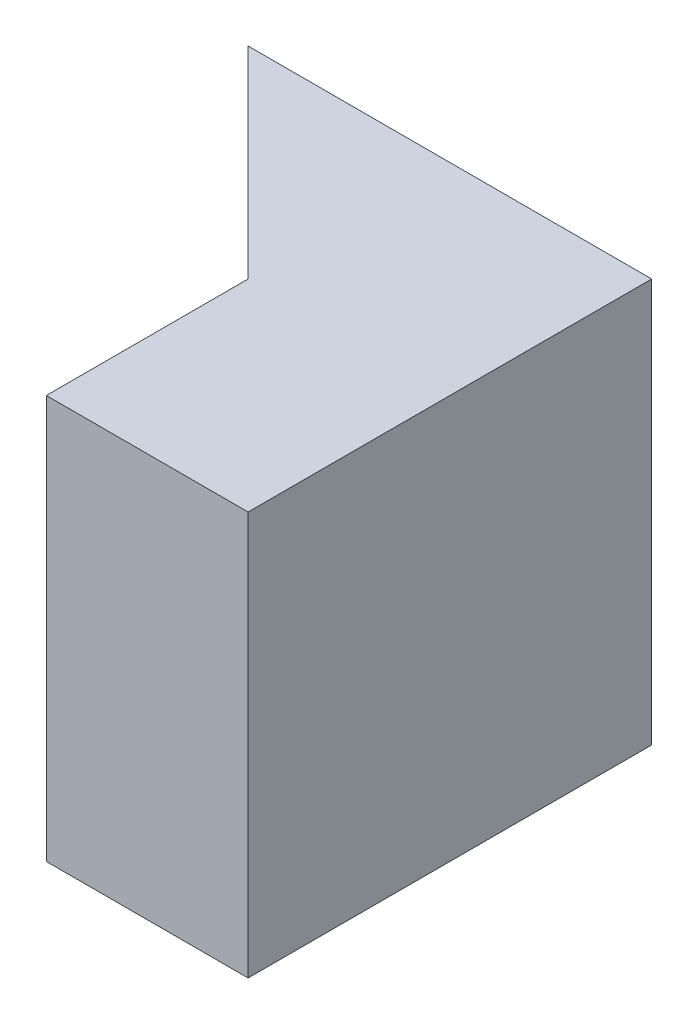
ISO-10303-21;
HEADER;
FILE_DESCRIPTION(('STEP AP214'),'2;1');
FILE_NAME('part.step','',(''),(''),'','','');
FILE_SCHEMA(('AUTOMOTIVE_DESIGN { 1 0 10303 214 1 1 1 1 }'));
ENDSEC;
DATA;
#1=APPLICATION_CONTEXT('core data for automotive mechanical design processes');
#2=APPLICATION_PROTOCOL_DEFINITION('international standard','automotive_design',2000,#1);
#3=PRODUCT_CONTEXT('',#1,'mechanical');
#4=PRODUCT('Part','Part','',(#3));
#5=PRODUCT_RELATED_PRODUCT_CATEGORY('part','',(#4));
#6=PRODUCT_DEFINITION_FORMATION('','',#4);
#7=PRODUCT_DEFINITION_CONTEXT('part definition',#1,'design');
#8=PRODUCT_DEFINITION('design','',#6,#7);
#9=PRODUCT_DEFINITION_SHAPE('','',#8);
#10=(LENGTH_UNIT() NAMED_UNIT(*) SI_UNIT(.MILLI.,.METRE.));
#11=(NAMED_UNIT(*) PLANE_ANGLE_UNIT() SI_UNIT($,.RADIAN.));
#12=(NAMED_UNIT(*) SI_UNIT($,.STERADIAN.) SOLID_ANGLE_UNIT());
#13=UNCERTAINTY_MEASURE_WITH_UNIT(LENGTH_MEASURE(1.E-05),#10,'distance_accuracy_value','');
#14=(GEOMETRIC_REPRESENTATION_CONTEXT(3) GLOBAL_UNCERTAINTY_ASSIGNED_CONTEXT((#13)) GLOBAL_UNIT_ASSIGNED_CONTEXT((#10,
#11,#12)) REPRESENTATION_CONTEXT('',''));
#15=CARTESIAN_POINT('',(0.,0.,0.));
#16=DIRECTION('',(0.,0.,1.));
#17=DIRECTION('',(1.,0.,0.));
#18=AXIS2_PLACEMENT_3D('',#15,#16,#17);
#19=CARTESIAN_POINT('',(0.,0.,20.));
#20=DIRECTION('',(0.,1.,0.));
#21=DIRECTION('',(0.,0.,1.));
#22=AXIS2_PLACEMENT_3D('',#19,#20,#21);
#23=PLANE('',#22);
#24=DIRECTION('',(0.,0.,-1.));
#25=VECTOR('',#24,1.);
#26=CARTESIAN_POINT('',(10.,0.,20.));
#27=LINE('',#26,#25);
#28=CARTESIAN_POINT('',(10.,0.,20.));
#29=VERTEX_POINT('',#28);
#30=CARTESIAN_POINT('',(10.,0.,10.));
#31=VERTEX_POINT('',#30);
#32=EDGE_CURVE('E47',#29,#31,#27,.T.);
#33=ORIENTED_EDGE('',*,*,#32,.T.);
#34=DIRECTION('',(-0.707106781186548,0.,-0.707106781186547));
#35=VECTOR('',#34,1.);
#36=CARTESIAN_POINT('',(0.,0.,0.));
#37=LINE('',#36,#35);
#38=CARTESIAN_POINT('',(0.,0.,0.));
#39=VERTEX_POINT('',#38);
#40=EDGE_CURVE('E106',#31,#39,#37,.T.);
#41=ORIENTED_EDGE('',*,*,#40,.T.);
#42=DIRECTION('',(1.,0.,0.));
#43=VECTOR('',#42,1.);
#44=CARTESIAN_POINT('',(0.,0.,0.));
#45=LINE('',#44,#43);
#46=CARTESIAN_POINT('',(20.,0.,0.));
#47=VERTEX_POINT('',#46);
#48=EDGE_CURVE('E77',#39,#47,#45,.T.);
#49=ORIENTED_EDGE('',*,*,#48,.T.);
#50=DIRECTION('',(0.,0.,-1.));
#51=VECTOR('',#50,1.);
#52=CARTESIAN_POINT('',(20.,0.,20.));
#53=LINE('',#52,#51);
#54=CARTESIAN_POINT('',(20.,0.,20.));
#55=VERTEX_POINT('',#54);
#56=EDGE_CURVE('E11',#55,#47,#53,.T.);
#57=ORIENTED_EDGE('',*,*,#56,.F.);
#58=DIRECTION('',(1.,0.,0.));
#59=VECTOR('',#58,1.);
#60=CARTESIAN_POINT('',(0.,0.,20.));
#61=LINE('',#60,#59);
#62=EDGE_CURVE('E90',#29,#55,#61,.T.);
#63=ORIENTED_EDGE('',*,*,#62,.F.);
#64=EDGE_LOOP('',(#33,#41,#49,#57,#63));
#65=FACE_BOUND('',#64,.T.);
#66=ADVANCED_FACE('F33',(#65),#23,.F.);
#67=CARTESIAN_POINT('',(20.,0.,20.));
#68=DIRECTION('',(-1.,0.,0.));
#69=DIRECTION('',(0.,-1.,0.));
#70=AXIS2_PLACEMENT_3D('',#67,#68,#69);
#71=PLANE('',#70);
#72=DIRECTION('',(0.,1.,0.));
#73=VECTOR('',#72,1.);
#74=CARTESIAN_POINT('',(20.,0.,0.));
#75=LINE('',#74,#73);
#76=CARTESIAN_POINT('',(20.,20.,0.));
#77=VERTEX_POINT('',#76);
#78=EDGE_CURVE('E68',#47,#77,#75,.T.);
#79=ORIENTED_EDGE('',*,*,#78,.T.);
#80=DIRECTION('',(0.,0.,-1.));
#81=VECTOR('',#80,1.);
#82=CARTESIAN_POINT('',(20.,20.,20.));
#83=LINE('',#82,#81);
#84=CARTESIAN_POINT('',(20.,20.,20.));
#85=VERTEX_POINT('',#84);
#86=EDGE_CURVE('E40',#85,#77,#83,.T.);
#87=ORIENTED_EDGE('',*,*,#86,.F.);
#88=DIRECTION('',(0.,1.,0.));
#89=VECTOR('',#88,1.);
#90=CARTESIAN_POINT('',(20.,0.,20.));
#91=LINE('',#90,#89);
#92=EDGE_CURVE('E56',#55,#85,#91,.T.);
#93=ORIENTED_EDGE('',*,*,#92,.F.);
#94=ORIENTED_EDGE('',*,*,#56,.T.);
#95=EDGE_LOOP('',(#79,#87,#93,#94));
#96=FACE_BOUND('',#95,.T.);
#97=ADVANCED_FACE('F70',(#96),#71,.F.);
#98=CARTESIAN_POINT('',(0.,20.,20.));
#99=DIRECTION('',(0.,-1.,0.));
#100=DIRECTION('',(0.,0.,-1.));
#101=AXIS2_PLACEMENT_3D('',#98,#99,#100);
#102=PLANE('',#101);
#103=DIRECTION('',(-1.,0.,0.));
#104=VECTOR('',#103,1.);
#105=CARTESIAN_POINT('',(0.,20.,0.));
#106=LINE('',#105,#104);
#107=CARTESIAN_POINT('',(0.,20.,0.));
#108=VERTEX_POINT('',#107);
#109=EDGE_CURVE('E76',#77,#108,#106,.T.);
#110=ORIENTED_EDGE('',*,*,#109,.T.);
#111=DIRECTION('',(-0.707106781186548,0.,-0.707106781186547));
#112=VECTOR('',#111,1.);
#113=CARTESIAN_POINT('',(0.,20.,0.));
#114=LINE('',#113,#112);
#115=CARTESIAN_POINT('',(10.,20.,10.));
#116=VERTEX_POINT('',#115);
#117=EDGE_CURVE('E108',#116,#108,#114,.T.);
#118=ORIENTED_EDGE('',*,*,#117,.F.);
#119=DIRECTION('',(0.,0.,-1.));
#120=VECTOR('',#119,1.);
#121=CARTESIAN_POINT('',(10.,20.,20.));
#122=LINE('',#121,#120);
#123=CARTESIAN_POINT('',(10.,20.,20.));
#124=VERTEX_POINT('',#123);
#125=EDGE_CURVE('E103',#124,#116,#122,.T.);
#126=ORIENTED_EDGE('',*,*,#125,.F.);
#127=DIRECTION('',(-1.,0.,0.));
#128=VECTOR('',#127,1.);
#129=CARTESIAN_POINT('',(0.,20.,20.));
#130=LINE('',#129,#128);
#131=EDGE_CURVE('E86',#85,#124,#130,.T.);
#132=ORIENTED_EDGE('',*,*,#131,.F.);
#133=ORIENTED_EDGE('',*,*,#86,.T.);
#134=EDGE_LOOP('',(#110,#118,#126,#132,#133));
#135=FACE_BOUND('',#134,.T.);
#136=ADVANCED_FACE('F81',(#135),#102,.F.);
#137=CARTESIAN_POINT('',(0.,0.,20.));
#138=DIRECTION('',(0.,0.,-1.));
#139=DIRECTION('',(-1.,0.,0.));
#140=AXIS2_PLACEMENT_3D('',#137,#138,#139);
#141=PLANE('',#140);
#142=ORIENTED_EDGE('',*,*,#131,.T.);
#143=DIRECTION('',(0.,1.,0.));
#144=VECTOR('',#143,1.);
#145=CARTESIAN_POINT('',(10.,0.,20.));
#146=LINE('',#145,#144);
#147=EDGE_CURVE('E99',#29,#124,#146,.T.);
#148=ORIENTED_EDGE('',*,*,#147,.F.);
#149=ORIENTED_EDGE('',*,*,#62,.T.);
#150=ORIENTED_EDGE('',*,*,#92,.T.);
#151=EDGE_LOOP('',(#142,#148,#149,#150));
#152=FACE_BOUND('',#151,.T.);
#153=ADVANCED_FACE('F124',(#152),#141,.F.);
#154=CARTESIAN_POINT('',(0.,0.,0.));
#155=DIRECTION('',(0.,0.,-1.));
#156=DIRECTION('',(-1.,0.,0.));
#157=AXIS2_PLACEMENT_3D('',#154,#155,#156);
#158=PLANE('',#157);
#159=DIRECTION('',(0.,-1.,0.));
#160=VECTOR('',#159,1.);
#161=CARTESIAN_POINT('',(0.,0.,0.));
#162=LINE('',#161,#160);
#163=EDGE_CURVE('E89',#108,#39,#162,.T.);
#164=ORIENTED_EDGE('',*,*,#163,.F.);
#165=ORIENTED_EDGE('',*,*,#109,.F.);
#166=ORIENTED_EDGE('',*,*,#78,.F.);
#167=ORIENTED_EDGE('',*,*,#48,.F.);
#168=EDGE_LOOP('',(#164,#165,#166,#167));
#169=FACE_BOUND('',#168,.T.);
#170=ADVANCED_FACE('F87',(#169),#158,.T.);
#171=CARTESIAN_POINT('',(10.,0.,20.));
#172=DIRECTION('',(1.,0.,0.));
#173=DIRECTION('',(0.,0.,-1.));
#174=AXIS2_PLACEMENT_3D('',#171,#172,#173);
#175=PLANE('',#174);
#176=ORIENTED_EDGE('',*,*,#125,.T.);
#177=DIRECTION('',(0.,1.,0.));
#178=VECTOR('',#177,1.);
#179=CARTESIAN_POINT('',(10.,0.,10.));
#180=LINE('',#179,#178);
#181=EDGE_CURVE('E96',#31,#116,#180,.T.);
#182=ORIENTED_EDGE('',*,*,#181,.F.);
#183=ORIENTED_EDGE('',*,*,#32,.F.);
#184=ORIENTED_EDGE('',*,*,#147,.T.);
#185=EDGE_LOOP('',(#176,#182,#183,#184));
#186=FACE_BOUND('',#185,.T.);
#187=ADVANCED_FACE('F122',(#186),#175,.F.);
#188=CARTESIAN_POINT('',(0.,0.,0.));
#189=DIRECTION('',(0.707106781186547,0.,-0.707106781186548));
#190=DIRECTION('',(-0.707106781186548,0.,-0.707106781186547));
#191=AXIS2_PLACEMENT_3D('',#188,#189,#190);
#192=PLANE('',#191);
#193=ORIENTED_EDGE('',*,*,#117,.T.);
#194=ORIENTED_EDGE('',*,*,#163,.T.);
#195=ORIENTED_EDGE('',*,*,#40,.F.);
#196=ORIENTED_EDGE('',*,*,#181,.T.);
#197=EDGE_LOOP('',(#193,#194,#195,#196));
#198=FACE_BOUND('',#197,.T.);
#199=ADVANCED_FACE('F119',(#198),#192,.F.);
#200=CLOSED_SHELL('',(#66,#97,#136,#153,#170,#187,#199));
#201=MANIFOLD_SOLID_BREP('B2',#200);
#202=ADVANCED_BREP_SHAPE_REPRESENTATION('',(#18,#201),#14);
#203=SHAPE_DEFINITION_REPRESENTATION(#9,#202);
ENDSEC;
END-ISO-10303-21;
